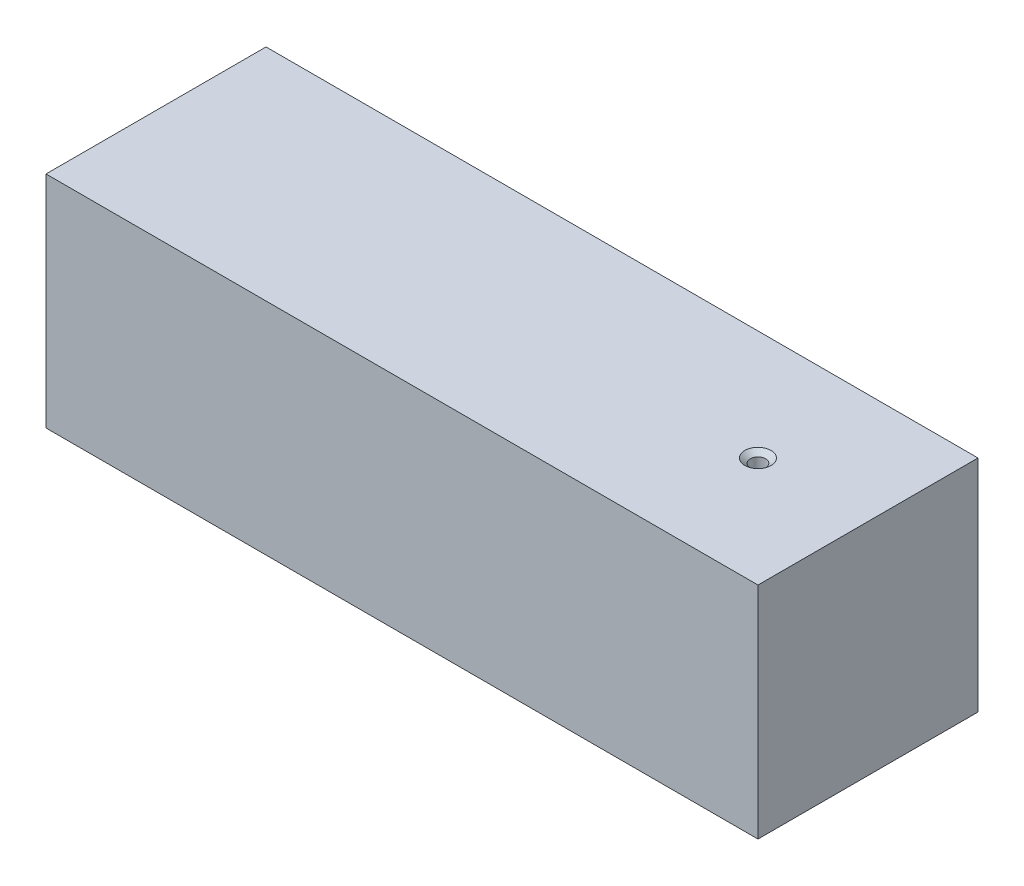
ISO-10303-21;
HEADER;
FILE_DESCRIPTION(('STEP AP214'),'2;1');
FILE_NAME('part.step','',(''),(''),'','','');
FILE_SCHEMA(('AUTOMOTIVE_DESIGN { 1 0 10303 214 1 1 1 1 }'));
ENDSEC;
DATA;
#1=APPLICATION_CONTEXT('core data for automotive mechanical design processes');
#2=APPLICATION_PROTOCOL_DEFINITION('international standard','automotive_design',2000,#1);
#3=PRODUCT_CONTEXT('',#1,'mechanical');
#4=PRODUCT('Part','Part','',(#3));
#5=PRODUCT_RELATED_PRODUCT_CATEGORY('part','',(#4));
#6=PRODUCT_DEFINITION_FORMATION('','',#4);
#7=PRODUCT_DEFINITION_CONTEXT('part definition',#1,'design');
#8=PRODUCT_DEFINITION('design','',#6,#7);
#9=PRODUCT_DEFINITION_SHAPE('','',#8);
#10=(LENGTH_UNIT() NAMED_UNIT(*) SI_UNIT(.MILLI.,.METRE.));
#11=(NAMED_UNIT(*) PLANE_ANGLE_UNIT() SI_UNIT($,.RADIAN.));
#12=(NAMED_UNIT(*) SI_UNIT($,.STERADIAN.) SOLID_ANGLE_UNIT());
#13=UNCERTAINTY_MEASURE_WITH_UNIT(LENGTH_MEASURE(1.E-05),#10,'distance_accuracy_value','');
#14=(GEOMETRIC_REPRESENTATION_CONTEXT(3) GLOBAL_UNCERTAINTY_ASSIGNED_CONTEXT((#13)) GLOBAL_UNIT_ASSIGNED_CONTEXT((#10,
#11,#12)) REPRESENTATION_CONTEXT('',''));
#15=CARTESIAN_POINT('',(0.,0.,0.));
#16=DIRECTION('',(0.,0.,1.));
#17=DIRECTION('',(1.,0.,0.));
#18=AXIS2_PLACEMENT_3D('',#15,#16,#17);
#19=CARTESIAN_POINT('',(41.095,25.4,12.7));
#20=DIRECTION('',(-1.,0.,0.));
#21=DIRECTION('',(0.,0.,1.));
#22=AXIS2_PLACEMENT_3D('',#19,#20,#21);
#23=PLANE('',#22);
#24=DIRECTION('',(0.,0.,-1.));
#25=VECTOR('',#24,1.);
#26=CARTESIAN_POINT('',(41.095,0.,12.7));
#27=LINE('',#26,#25);
#28=CARTESIAN_POINT('',(41.095,0.,12.7));
#29=VERTEX_POINT('',#28);
#30=CARTESIAN_POINT('',(41.095,0.,-12.7));
#31=VERTEX_POINT('',#30);
#32=EDGE_CURVE('E113',#29,#31,#27,.T.);
#33=ORIENTED_EDGE('',*,*,#32,.T.);
#34=DIRECTION('',(0.,-1.,0.));
#35=VECTOR('',#34,1.);
#36=CARTESIAN_POINT('',(41.095,25.4,-12.7));
#37=LINE('',#36,#35);
#38=CARTESIAN_POINT('',(41.095,25.4,-12.7));
#39=VERTEX_POINT('',#38);
#40=EDGE_CURVE('E11',#39,#31,#37,.T.);
#41=ORIENTED_EDGE('',*,*,#40,.F.);
#42=DIRECTION('',(0.,0.,-1.));
#43=VECTOR('',#42,1.);
#44=CARTESIAN_POINT('',(41.095,25.4,12.7));
#45=LINE('',#44,#43);
#46=CARTESIAN_POINT('',(41.095,25.4,12.7));
#47=VERTEX_POINT('',#46);
#48=EDGE_CURVE('E114',#47,#39,#45,.T.);
#49=ORIENTED_EDGE('',*,*,#48,.F.);
#50=DIRECTION('',(0.,-1.,0.));
#51=VECTOR('',#50,1.);
#52=CARTESIAN_POINT('',(41.095,25.4,12.7));
#53=LINE('',#52,#51);
#54=EDGE_CURVE('E120',#47,#29,#53,.T.);
#55=ORIENTED_EDGE('',*,*,#54,.T.);
#56=EDGE_LOOP('',(#33,#41,#49,#55));
#57=FACE_BOUND('',#56,.T.);
#58=ADVANCED_FACE('F36',(#57),#23,.F.);
#59=CARTESIAN_POINT('',(-41.095,25.4,-12.7));
#60=DIRECTION('',(0.,0.,1.));
#61=DIRECTION('',(1.,0.,0.));
#62=AXIS2_PLACEMENT_3D('',#59,#60,#61);
#63=PLANE('',#62);
#64=DIRECTION('',(-1.,0.,0.));
#65=VECTOR('',#64,1.);
#66=CARTESIAN_POINT('',(-41.095,0.,-12.7));
#67=LINE('',#66,#65);
#68=CARTESIAN_POINT('',(-41.095,0.,-12.7));
#69=VERTEX_POINT('',#68);
#70=EDGE_CURVE('E123',#31,#69,#67,.T.);
#71=ORIENTED_EDGE('',*,*,#70,.T.);
#72=DIRECTION('',(0.,-1.,0.));
#73=VECTOR('',#72,1.);
#74=CARTESIAN_POINT('',(-41.095,25.4,-12.7));
#75=LINE('',#74,#73);
#76=CARTESIAN_POINT('',(-41.095,25.4,-12.7));
#77=VERTEX_POINT('',#76);
#78=EDGE_CURVE('E44',#77,#69,#75,.T.);
#79=ORIENTED_EDGE('',*,*,#78,.F.);
#80=DIRECTION('',(-1.,0.,0.));
#81=VECTOR('',#80,1.);
#82=CARTESIAN_POINT('',(-41.095,25.4,-12.7));
#83=LINE('',#82,#81);
#84=EDGE_CURVE('E83',#39,#77,#83,.T.);
#85=ORIENTED_EDGE('',*,*,#84,.F.);
#86=ORIENTED_EDGE('',*,*,#40,.T.);
#87=EDGE_LOOP('',(#71,#79,#85,#86));
#88=FACE_BOUND('',#87,.T.);
#89=ADVANCED_FACE('F147',(#88),#63,.F.);
#90=CARTESIAN_POINT('',(-41.095,25.4,12.7));
#91=DIRECTION('',(1.,0.,0.));
#92=DIRECTION('',(0.,0.,-1.));
#93=AXIS2_PLACEMENT_3D('',#90,#91,#92);
#94=PLANE('',#93);
#95=CARTESIAN_POINT('',(-41.095,12.7,0.));
#96=DIRECTION('',(-1.,0.,0.));
#97=DIRECTION('',(0.,0.,1.));
#98=AXIS2_PLACEMENT_3D('',#95,#96,#97);
#99=CIRCLE('',#98,1.5113);
#100=CARTESIAN_POINT('',(-41.095,12.7,1.5113));
#101=VERTEX_POINT('',#100);
#102=EDGE_CURVE('E104',#101,#101,#99,.T.);
#103=ORIENTED_EDGE('',*,*,#102,.F.);
#104=EDGE_LOOP('',(#103));
#105=FACE_BOUND('',#104,.T.);
#106=DIRECTION('',(0.,0.,1.));
#107=VECTOR('',#106,1.);
#108=CARTESIAN_POINT('',(-41.095,0.,12.7));
#109=LINE('',#108,#107);
#110=CARTESIAN_POINT('',(-41.095,0.,12.7));
#111=VERTEX_POINT('',#110);
#112=EDGE_CURVE('E70',#69,#111,#109,.T.);
#113=ORIENTED_EDGE('',*,*,#112,.T.);
#114=DIRECTION('',(0.,-1.,0.));
#115=VECTOR('',#114,1.);
#116=CARTESIAN_POINT('',(-41.095,25.4,12.7));
#117=LINE('',#116,#115);
#118=CARTESIAN_POINT('',(-41.095,25.4,12.7));
#119=VERTEX_POINT('',#118);
#120=EDGE_CURVE('E128',#119,#111,#117,.T.);
#121=ORIENTED_EDGE('',*,*,#120,.F.);
#122=DIRECTION('',(0.,0.,1.));
#123=VECTOR('',#122,1.);
#124=CARTESIAN_POINT('',(-41.095,25.4,12.7));
#125=LINE('',#124,#123);
#126=EDGE_CURVE('E117',#77,#119,#125,.T.);
#127=ORIENTED_EDGE('',*,*,#126,.F.);
#128=ORIENTED_EDGE('',*,*,#78,.T.);
#129=EDGE_LOOP('',(#113,#121,#127,#128));
#130=FACE_BOUND('',#129,.T.);
#131=ADVANCED_FACE('F130',(#105,#130),#94,.F.);
#132=CARTESIAN_POINT('',(-41.095,25.4,12.7));
#133=DIRECTION('',(0.,0.,-1.));
#134=DIRECTION('',(-1.,0.,0.));
#135=AXIS2_PLACEMENT_3D('',#132,#133,#134);
#136=PLANE('',#135);
#137=DIRECTION('',(1.,0.,0.));
#138=VECTOR('',#137,1.);
#139=CARTESIAN_POINT('',(-41.095,0.,12.7));
#140=LINE('',#139,#138);
#141=EDGE_CURVE('E76',#111,#29,#140,.T.);
#142=ORIENTED_EDGE('',*,*,#141,.T.);
#143=ORIENTED_EDGE('',*,*,#54,.F.);
#144=DIRECTION('',(1.,0.,0.));
#145=VECTOR('',#144,1.);
#146=CARTESIAN_POINT('',(-41.095,25.4,12.7));
#147=LINE('',#146,#145);
#148=EDGE_CURVE('E52',#119,#47,#147,.T.);
#149=ORIENTED_EDGE('',*,*,#148,.F.);
#150=ORIENTED_EDGE('',*,*,#120,.T.);
#151=EDGE_LOOP('',(#142,#143,#149,#150));
#152=FACE_BOUND('',#151,.T.);
#153=ADVANCED_FACE('F137',(#152),#136,.F.);
#154=CARTESIAN_POINT('',(0.,25.4,0.));
#155=DIRECTION('',(0.,-1.,0.));
#156=DIRECTION('',(0.,0.,-1.));
#157=AXIS2_PLACEMENT_3D('',#154,#155,#156);
#158=PLANE('',#157);
#159=CARTESIAN_POINT('',(28.395,25.4,0.));
#160=DIRECTION('',(0.,1.,0.));
#161=DIRECTION('',(0.,0.,1.));
#162=AXIS2_PLACEMENT_3D('',#159,#160,#161);
#163=CIRCLE('',#162,1.5113);
#164=CARTESIAN_POINT('',(28.395,25.4,1.5113));
#165=VERTEX_POINT('',#164);
#166=EDGE_CURVE('E97',#165,#165,#163,.T.);
#167=ORIENTED_EDGE('',*,*,#166,.F.);
#168=EDGE_LOOP('',(#167));
#169=FACE_BOUND('',#168,.T.);
#170=ORIENTED_EDGE('',*,*,#48,.T.);
#171=ORIENTED_EDGE('',*,*,#84,.T.);
#172=ORIENTED_EDGE('',*,*,#126,.T.);
#173=ORIENTED_EDGE('',*,*,#148,.T.);
#174=EDGE_LOOP('',(#170,#171,#172,#173));
#175=FACE_BOUND('',#174,.T.);
#176=ADVANCED_FACE('F139',(#169,#175),#158,.F.);
#177=CARTESIAN_POINT('',(0.,0.,0.));
#178=DIRECTION('',(0.,-1.,0.));
#179=DIRECTION('',(0.,0.,-1.));
#180=AXIS2_PLACEMENT_3D('',#177,#178,#179);
#181=PLANE('',#180);
#182=CARTESIAN_POINT('',(28.395,0.,0.));
#183=DIRECTION('',(0.,1.,0.));
#184=DIRECTION('',(0.,0.,1.));
#185=AXIS2_PLACEMENT_3D('',#182,#183,#184);
#186=CIRCLE('',#185,0.888999999999994);
#187=CARTESIAN_POINT('',(28.395,0.,0.888999999999996));
#188=VERTEX_POINT('',#187);
#189=EDGE_CURVE('E110',#188,#188,#186,.T.);
#190=ORIENTED_EDGE('',*,*,#189,.T.);
#191=EDGE_LOOP('',(#190));
#192=FACE_BOUND('',#191,.T.);
#193=ORIENTED_EDGE('',*,*,#32,.F.);
#194=ORIENTED_EDGE('',*,*,#141,.F.);
#195=ORIENTED_EDGE('',*,*,#112,.F.);
#196=ORIENTED_EDGE('',*,*,#70,.F.);
#197=EDGE_LOOP('',(#193,#194,#195,#196));
#198=FACE_BOUND('',#197,.T.);
#199=ADVANCED_FACE('F133',(#192,#198),#181,.T.);
#200=CARTESIAN_POINT('',(28.395,25.4,0.));
#201=DIRECTION('',(0.,1.,0.));
#202=DIRECTION('',(0.,0.,1.));
#203=AXIS2_PLACEMENT_3D('',#200,#201,#202);
#204=CYLINDRICAL_SURFACE('',#203,0.888999999999996);
#205=ORIENTED_EDGE('',*,*,#189,.F.);
#206=EDGE_LOOP('',(#205));
#207=FACE_BOUND('',#206,.T.);
#208=CARTESIAN_POINT('',(28.395,24.8778282995184,0.));
#209=DIRECTION('',(0.,1.,0.));
#210=DIRECTION('',(0.,0.,1.));
#211=AXIS2_PLACEMENT_3D('',#208,#209,#210);
#212=CIRCLE('',#211,0.888999999999997);
#213=CARTESIAN_POINT('',(28.395,24.8778282995184,0.888999999999999));
#214=VERTEX_POINT('',#213);
#215=EDGE_CURVE('E101',#214,#214,#212,.T.);
#216=ORIENTED_EDGE('',*,*,#215,.T.);
#217=EDGE_LOOP('',(#216));
#218=FACE_BOUND('',#217,.T.);
#219=ADVANCED_FACE('F201',(#207,#218),#204,.F.);
#220=CARTESIAN_POINT('',(28.395,25.4,0.));
#221=DIRECTION('',(0.,1.,0.));
#222=DIRECTION('',(0.,0.,1.));
#223=AXIS2_PLACEMENT_3D('',#220,#221,#222);
#224=CONICAL_SURFACE('',#223,1.5113,0.872664625997163);
#225=ORIENTED_EDGE('',*,*,#215,.F.);
#226=EDGE_LOOP('',(#225));
#227=FACE_BOUND('',#226,.T.);
#228=ORIENTED_EDGE('',*,*,#166,.T.);
#229=EDGE_LOOP('',(#228));
#230=FACE_BOUND('',#229,.T.);
#231=ADVANCED_FACE('F91',(#227,#230),#224,.F.);
#232=CARTESIAN_POINT('',(-21.095,12.7,0.));
#233=DIRECTION('',(-1.,0.,0.));
#234=DIRECTION('',(0.,0.,1.));
#235=AXIS2_PLACEMENT_3D('',#232,#233,#234);
#236=CONICAL_SURFACE('',#235,0.595629999999986,1.02974425867665);
#237=CARTESIAN_POINT('',(-20.7371093894886,12.7,0.));
#238=VERTEX_POINT('',#237);
#239=VERTEX_LOOP('',#238);
#240=FACE_BOUND('',#239,.T.);
#241=CARTESIAN_POINT('',(-21.095,12.7,0.));
#242=DIRECTION('',(-1.,0.,0.));
#243=DIRECTION('',(0.,0.,1.));
#244=AXIS2_PLACEMENT_3D('',#241,#242,#243);
#245=CIRCLE('',#244,0.595629999999986);
#246=CARTESIAN_POINT('',(-21.095,12.7,0.595629999999986));
#247=VERTEX_POINT('',#246);
#248=EDGE_CURVE('E95',#247,#247,#245,.T.);
#249=ORIENTED_EDGE('',*,*,#248,.T.);
#250=EDGE_LOOP('',(#249));
#251=FACE_BOUND('',#250,.T.);
#252=ADVANCED_FACE('F87',(#240,#251),#236,.F.);
#253=CARTESIAN_POINT('',(-41.095,12.7,0.));
#254=DIRECTION('',(-1.,0.,0.));
#255=DIRECTION('',(0.,0.,1.));
#256=AXIS2_PLACEMENT_3D('',#253,#254,#255);
#257=CYLINDRICAL_SURFACE('',#256,0.595629999999987);
#258=ORIENTED_EDGE('',*,*,#248,.F.);
#259=EDGE_LOOP('',(#258));
#260=FACE_BOUND('',#259,.T.);
#261=CARTESIAN_POINT('',(-40.3266616407199,12.7,0.));
#262=DIRECTION('',(-1.,0.,0.));
#263=DIRECTION('',(0.,0.,1.));
#264=AXIS2_PLACEMENT_3D('',#261,#262,#263);
#265=CIRCLE('',#264,0.595629999999988);
#266=CARTESIAN_POINT('',(-40.3266616407199,12.7,0.595629999999988));
#267=VERTEX_POINT('',#266);
#268=EDGE_CURVE('E98',#267,#267,#265,.T.);
#269=ORIENTED_EDGE('',*,*,#268,.T.);
#270=EDGE_LOOP('',(#269));
#271=FACE_BOUND('',#270,.T.);
#272=ADVANCED_FACE('F90',(#260,#271),#257,.F.);
#273=CARTESIAN_POINT('',(-41.095,12.7,0.));
#274=DIRECTION('',(-1.,0.,0.));
#275=DIRECTION('',(0.,0.,1.));
#276=AXIS2_PLACEMENT_3D('',#273,#274,#275);
#277=CONICAL_SURFACE('',#276,1.5113,0.872664625997163);
#278=ORIENTED_EDGE('',*,*,#268,.F.);
#279=EDGE_LOOP('',(#278));
#280=FACE_BOUND('',#279,.T.);
#281=ORIENTED_EDGE('',*,*,#102,.T.);
#282=EDGE_LOOP('',(#281));
#283=FACE_BOUND('',#282,.T.);
#284=ADVANCED_FACE('F183',(#280,#283),#277,.F.);
#285=CLOSED_SHELL('',(#58,#89,#131,#153,#176,#199,#219,#231,#252,#272,#284));
#286=MANIFOLD_SOLID_BREP('B2',#285);
#287=ADVANCED_BREP_SHAPE_REPRESENTATION('',(#18,#286),#14);
#288=SHAPE_DEFINITION_REPRESENTATION(#9,#287);
ENDSEC;
END-ISO-10303-21;
